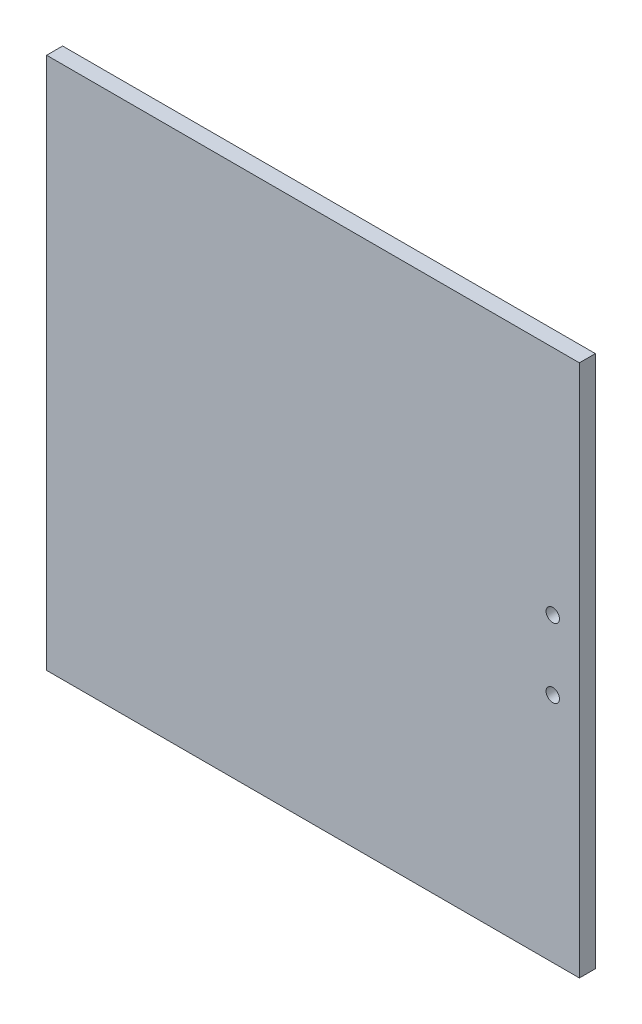
ISO-10303-21;
HEADER;
FILE_DESCRIPTION(('STEP AP214'),'2;1');
FILE_NAME('part.step','',(''),(''),'','','');
FILE_SCHEMA(('AUTOMOTIVE_DESIGN { 1 0 10303 214 1 1 1 1 }'));
ENDSEC;
DATA;
#1=APPLICATION_CONTEXT('core data for automotive mechanical design processes');
#2=APPLICATION_PROTOCOL_DEFINITION('international standard','automotive_design',2000,#1);
#3=PRODUCT_CONTEXT('',#1,'mechanical');
#4=PRODUCT('Part','Part','',(#3));
#5=PRODUCT_RELATED_PRODUCT_CATEGORY('part','',(#4));
#6=PRODUCT_DEFINITION_FORMATION('','',#4);
#7=PRODUCT_DEFINITION_CONTEXT('part definition',#1,'design');
#8=PRODUCT_DEFINITION('design','',#6,#7);
#9=PRODUCT_DEFINITION_SHAPE('','',#8);
#10=(LENGTH_UNIT() NAMED_UNIT(*) SI_UNIT(.MILLI.,.METRE.));
#11=(NAMED_UNIT(*) PLANE_ANGLE_UNIT() SI_UNIT($,.RADIAN.));
#12=(NAMED_UNIT(*) SI_UNIT($,.STERADIAN.) SOLID_ANGLE_UNIT());
#13=UNCERTAINTY_MEASURE_WITH_UNIT(LENGTH_MEASURE(1.E-05),#10,'distance_accuracy_value','');
#14=(GEOMETRIC_REPRESENTATION_CONTEXT(3) GLOBAL_UNCERTAINTY_ASSIGNED_CONTEXT((#13)) GLOBAL_UNIT_ASSIGNED_CONTEXT((#10,
#11,#12)) REPRESENTATION_CONTEXT('',''));
#15=CARTESIAN_POINT('',(0.,0.,0.));
#16=DIRECTION('',(0.,0.,1.));
#17=DIRECTION('',(1.,0.,0.));
#18=AXIS2_PLACEMENT_3D('',#15,#16,#17);
#19=CARTESIAN_POINT('',(0.,0.,6.));
#20=DIRECTION('',(0.,0.,-1.));
#21=DIRECTION('',(-1.,0.,0.));
#22=AXIS2_PLACEMENT_3D('',#19,#20,#21);
#23=PLANE('',#22);
#24=DIRECTION('',(0.,1.,0.));
#25=VECTOR('',#24,1.);
#26=CARTESIAN_POINT('',(100.,-100.,6.));
#27=LINE('',#26,#25);
#28=CARTESIAN_POINT('',(100.,-100.,6.));
#29=VERTEX_POINT('',#28);
#30=CARTESIAN_POINT('',(100.,100.,6.));
#31=VERTEX_POINT('',#30);
#32=EDGE_CURVE('E87',#29,#31,#27,.T.);
#33=ORIENTED_EDGE('',*,*,#32,.T.);
#34=DIRECTION('',(-1.,0.,0.));
#35=VECTOR('',#34,1.);
#36=CARTESIAN_POINT('',(-100.,100.,6.));
#37=LINE('',#36,#35);
#38=CARTESIAN_POINT('',(-100.,100.,6.));
#39=VERTEX_POINT('',#38);
#40=EDGE_CURVE('E82',#31,#39,#37,.T.);
#41=ORIENTED_EDGE('',*,*,#40,.T.);
#42=DIRECTION('',(0.,-1.,0.));
#43=VECTOR('',#42,1.);
#44=CARTESIAN_POINT('',(-100.,-100.,6.));
#45=LINE('',#44,#43);
#46=CARTESIAN_POINT('',(-100.,-100.,6.));
#47=VERTEX_POINT('',#46);
#48=EDGE_CURVE('E85',#39,#47,#45,.T.);
#49=ORIENTED_EDGE('',*,*,#48,.T.);
#50=DIRECTION('',(1.,0.,0.));
#51=VECTOR('',#50,1.);
#52=CARTESIAN_POINT('',(-100.,-100.,6.));
#53=LINE('',#52,#51);
#54=EDGE_CURVE('E52',#47,#29,#53,.T.);
#55=ORIENTED_EDGE('',*,*,#54,.T.);
#56=EDGE_LOOP('',(#33,#41,#49,#55));
#57=FACE_BOUND('',#56,.T.);
#58=CARTESIAN_POINT('',(90.,13.,6.));
#59=DIRECTION('',(0.,0.,1.));
#60=DIRECTION('',(1.,0.,0.));
#61=AXIS2_PLACEMENT_3D('',#58,#59,#60);
#62=CIRCLE('',#61,2.50000000000001);
#63=CARTESIAN_POINT('',(92.5,13.,6.));
#64=VERTEX_POINT('',#63);
#65=EDGE_CURVE('E102',#64,#64,#62,.T.);
#66=ORIENTED_EDGE('',*,*,#65,.F.);
#67=EDGE_LOOP('',(#66));
#68=FACE_BOUND('',#67,.T.);
#69=CARTESIAN_POINT('',(90.,-13.,6.));
#70=DIRECTION('',(0.,0.,1.));
#71=DIRECTION('',(1.,0.,0.));
#72=AXIS2_PLACEMENT_3D('',#69,#70,#71);
#73=CIRCLE('',#72,2.5);
#74=CARTESIAN_POINT('',(92.5,-13.,6.));
#75=VERTEX_POINT('',#74);
#76=EDGE_CURVE('E117',#75,#75,#73,.T.);
#77=ORIENTED_EDGE('',*,*,#76,.F.);
#78=EDGE_LOOP('',(#77));
#79=FACE_BOUND('',#78,.T.);
#80=ADVANCED_FACE('F35',(#57,#68,#79),#23,.F.);
#81=CARTESIAN_POINT('',(0.,0.,0.));
#82=DIRECTION('',(0.,0.,-1.));
#83=DIRECTION('',(-1.,0.,0.));
#84=AXIS2_PLACEMENT_3D('',#81,#82,#83);
#85=PLANE('',#84);
#86=CARTESIAN_POINT('',(90.,13.,0.));
#87=DIRECTION('',(0.,0.,1.));
#88=DIRECTION('',(1.,0.,0.));
#89=AXIS2_PLACEMENT_3D('',#86,#87,#88);
#90=CIRCLE('',#89,2.50000000000001);
#91=CARTESIAN_POINT('',(92.5,13.,0.));
#92=VERTEX_POINT('',#91);
#93=EDGE_CURVE('E114',#92,#92,#90,.T.);
#94=ORIENTED_EDGE('',*,*,#93,.T.);
#95=EDGE_LOOP('',(#94));
#96=FACE_BOUND('',#95,.T.);
#97=DIRECTION('',(0.,1.,0.));
#98=VECTOR('',#97,1.);
#99=CARTESIAN_POINT('',(100.,-100.,0.));
#100=LINE('',#99,#98);
#101=CARTESIAN_POINT('',(100.,-100.,0.));
#102=VERTEX_POINT('',#101);
#103=CARTESIAN_POINT('',(100.,100.,0.));
#104=VERTEX_POINT('',#103);
#105=EDGE_CURVE('E99',#102,#104,#100,.T.);
#106=ORIENTED_EDGE('',*,*,#105,.F.);
#107=DIRECTION('',(1.,0.,0.));
#108=VECTOR('',#107,1.);
#109=CARTESIAN_POINT('',(-100.,-100.,0.));
#110=LINE('',#109,#108);
#111=CARTESIAN_POINT('',(-100.,-100.,0.));
#112=VERTEX_POINT('',#111);
#113=EDGE_CURVE('E75',#112,#102,#110,.T.);
#114=ORIENTED_EDGE('',*,*,#113,.F.);
#115=DIRECTION('',(0.,-1.,0.));
#116=VECTOR('',#115,1.);
#117=CARTESIAN_POINT('',(-100.,-100.,0.));
#118=LINE('',#117,#116);
#119=CARTESIAN_POINT('',(-100.,100.,0.));
#120=VERTEX_POINT('',#119);
#121=EDGE_CURVE('E69',#120,#112,#118,.T.);
#122=ORIENTED_EDGE('',*,*,#121,.F.);
#123=DIRECTION('',(-1.,0.,0.));
#124=VECTOR('',#123,1.);
#125=CARTESIAN_POINT('',(-100.,100.,0.));
#126=LINE('',#125,#124);
#127=EDGE_CURVE('E91',#104,#120,#126,.T.);
#128=ORIENTED_EDGE('',*,*,#127,.F.);
#129=EDGE_LOOP('',(#106,#114,#122,#128));
#130=FACE_BOUND('',#129,.T.);
#131=CARTESIAN_POINT('',(90.,-13.,0.));
#132=DIRECTION('',(0.,0.,1.));
#133=DIRECTION('',(1.,0.,0.));
#134=AXIS2_PLACEMENT_3D('',#131,#132,#133);
#135=CIRCLE('',#134,2.5);
#136=CARTESIAN_POINT('',(92.5,-13.,0.));
#137=VERTEX_POINT('',#136);
#138=EDGE_CURVE('E120',#137,#137,#135,.T.);
#139=ORIENTED_EDGE('',*,*,#138,.T.);
#140=EDGE_LOOP('',(#139));
#141=FACE_BOUND('',#140,.T.);
#142=ADVANCED_FACE('F110',(#96,#130,#141),#85,.T.);
#143=CARTESIAN_POINT('',(100.,-100.,6.));
#144=DIRECTION('',(-1.,0.,0.));
#145=DIRECTION('',(0.,0.,1.));
#146=AXIS2_PLACEMENT_3D('',#143,#144,#145);
#147=PLANE('',#146);
#148=ORIENTED_EDGE('',*,*,#105,.T.);
#149=DIRECTION('',(0.,0.,-1.));
#150=VECTOR('',#149,1.);
#151=CARTESIAN_POINT('',(100.,100.,6.));
#152=LINE('',#151,#150);
#153=EDGE_CURVE('E11',#31,#104,#152,.T.);
#154=ORIENTED_EDGE('',*,*,#153,.F.);
#155=ORIENTED_EDGE('',*,*,#32,.F.);
#156=DIRECTION('',(0.,0.,-1.));
#157=VECTOR('',#156,1.);
#158=CARTESIAN_POINT('',(100.,-100.,6.));
#159=LINE('',#158,#157);
#160=EDGE_CURVE('E95',#29,#102,#159,.T.);
#161=ORIENTED_EDGE('',*,*,#160,.T.);
#162=EDGE_LOOP('',(#148,#154,#155,#161));
#163=FACE_BOUND('',#162,.T.);
#164=ADVANCED_FACE('F37',(#163),#147,.F.);
#165=CARTESIAN_POINT('',(-100.,100.,6.));
#166=DIRECTION('',(0.,-1.,0.));
#167=DIRECTION('',(0.,0.,-1.));
#168=AXIS2_PLACEMENT_3D('',#165,#166,#167);
#169=PLANE('',#168);
#170=ORIENTED_EDGE('',*,*,#127,.T.);
#171=DIRECTION('',(0.,0.,-1.));
#172=VECTOR('',#171,1.);
#173=CARTESIAN_POINT('',(-100.,100.,6.));
#174=LINE('',#173,#172);
#175=EDGE_CURVE('E44',#39,#120,#174,.T.);
#176=ORIENTED_EDGE('',*,*,#175,.F.);
#177=ORIENTED_EDGE('',*,*,#40,.F.);
#178=ORIENTED_EDGE('',*,*,#153,.T.);
#179=EDGE_LOOP('',(#170,#176,#177,#178));
#180=FACE_BOUND('',#179,.T.);
#181=ADVANCED_FACE('F90',(#180),#169,.F.);
#182=CARTESIAN_POINT('',(-100.,-100.,6.));
#183=DIRECTION('',(1.,0.,0.));
#184=DIRECTION('',(0.,0.,-1.));
#185=AXIS2_PLACEMENT_3D('',#182,#183,#184);
#186=PLANE('',#185);
#187=ORIENTED_EDGE('',*,*,#121,.T.);
#188=DIRECTION('',(0.,0.,-1.));
#189=VECTOR('',#188,1.);
#190=CARTESIAN_POINT('',(-100.,-100.,6.));
#191=LINE('',#190,#189);
#192=EDGE_CURVE('E92',#47,#112,#191,.T.);
#193=ORIENTED_EDGE('',*,*,#192,.F.);
#194=ORIENTED_EDGE('',*,*,#48,.F.);
#195=ORIENTED_EDGE('',*,*,#175,.T.);
#196=EDGE_LOOP('',(#187,#193,#194,#195));
#197=FACE_BOUND('',#196,.T.);
#198=ADVANCED_FACE('F93',(#197),#186,.F.);
#199=CARTESIAN_POINT('',(-100.,-100.,6.));
#200=DIRECTION('',(0.,1.,0.));
#201=DIRECTION('',(0.,0.,1.));
#202=AXIS2_PLACEMENT_3D('',#199,#200,#201);
#203=PLANE('',#202);
#204=ORIENTED_EDGE('',*,*,#113,.T.);
#205=ORIENTED_EDGE('',*,*,#160,.F.);
#206=ORIENTED_EDGE('',*,*,#54,.F.);
#207=ORIENTED_EDGE('',*,*,#192,.T.);
#208=EDGE_LOOP('',(#204,#205,#206,#207));
#209=FACE_BOUND('',#208,.T.);
#210=ADVANCED_FACE('F107',(#209),#203,.F.);
#211=CARTESIAN_POINT('',(90.,13.,6.));
#212=DIRECTION('',(0.,0.,-1.));
#213=DIRECTION('',(-1.,0.,0.));
#214=AXIS2_PLACEMENT_3D('',#211,#212,#213);
#215=CYLINDRICAL_SURFACE('',#214,2.50000000000001);
#216=ORIENTED_EDGE('',*,*,#65,.T.);
#217=EDGE_LOOP('',(#216));
#218=FACE_BOUND('',#217,.T.);
#219=ORIENTED_EDGE('',*,*,#93,.F.);
#220=EDGE_LOOP('',(#219));
#221=FACE_BOUND('',#220,.T.);
#222=ADVANCED_FACE('F137',(#218,#221),#215,.F.);
#223=CARTESIAN_POINT('',(90.,-13.,6.));
#224=DIRECTION('',(0.,0.,-1.));
#225=DIRECTION('',(-1.,0.,0.));
#226=AXIS2_PLACEMENT_3D('',#223,#224,#225);
#227=CYLINDRICAL_SURFACE('',#226,2.5);
#228=ORIENTED_EDGE('',*,*,#76,.T.);
#229=EDGE_LOOP('',(#228));
#230=FACE_BOUND('',#229,.T.);
#231=ORIENTED_EDGE('',*,*,#138,.F.);
#232=EDGE_LOOP('',(#231));
#233=FACE_BOUND('',#232,.T.);
#234=ADVANCED_FACE('F126',(#230,#233),#227,.F.);
#235=CLOSED_SHELL('',(#80,#142,#164,#181,#198,#210,#222,#234));
#236=MANIFOLD_SOLID_BREP('B2',#235);
#237=ADVANCED_BREP_SHAPE_REPRESENTATION('',(#18,#236),#14);
#238=SHAPE_DEFINITION_REPRESENTATION(#9,#237);
ENDSEC;
END-ISO-10303-21;
